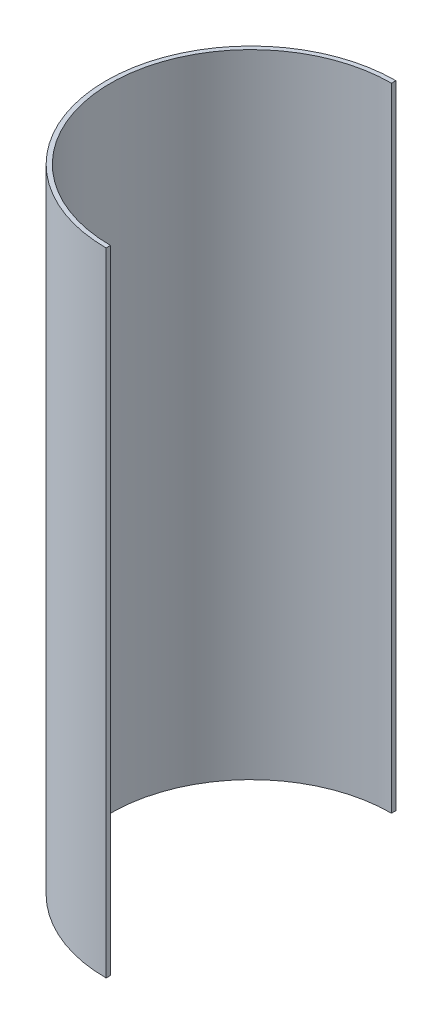
ISO-10303-21;
HEADER;
FILE_DESCRIPTION(('STEP AP214'),'2;1');
FILE_NAME('part.step','',(''),(''),'','','');
FILE_SCHEMA(('AUTOMOTIVE_DESIGN { 1 0 10303 214 1 1 1 1 }'));
ENDSEC;
DATA;
#1=APPLICATION_CONTEXT('core data for automotive mechanical design processes');
#2=APPLICATION_PROTOCOL_DEFINITION('international standard','automotive_design',2000,#1);
#3=PRODUCT_CONTEXT('',#1,'mechanical');
#4=PRODUCT('Part','Part','',(#3));
#5=PRODUCT_RELATED_PRODUCT_CATEGORY('part','',(#4));
#6=PRODUCT_DEFINITION_FORMATION('','',#4);
#7=PRODUCT_DEFINITION_CONTEXT('part definition',#1,'design');
#8=PRODUCT_DEFINITION('design','',#6,#7);
#9=PRODUCT_DEFINITION_SHAPE('','',#8);
#10=(LENGTH_UNIT() NAMED_UNIT(*) SI_UNIT(.MILLI.,.METRE.));
#11=(NAMED_UNIT(*) PLANE_ANGLE_UNIT() SI_UNIT($,.RADIAN.));
#12=(NAMED_UNIT(*) SI_UNIT($,.STERADIAN.) SOLID_ANGLE_UNIT());
#13=UNCERTAINTY_MEASURE_WITH_UNIT(LENGTH_MEASURE(1.E-05),#10,'distance_accuracy_value','');
#14=(GEOMETRIC_REPRESENTATION_CONTEXT(3) GLOBAL_UNCERTAINTY_ASSIGNED_CONTEXT((#13)) GLOBAL_UNIT_ASSIGNED_CONTEXT((#10,
#11,#12)) REPRESENTATION_CONTEXT('',''));
#15=CARTESIAN_POINT('',(0.,0.,0.));
#16=DIRECTION('',(0.,0.,1.));
#17=DIRECTION('',(1.,0.,0.));
#18=AXIS2_PLACEMENT_3D('',#15,#16,#17);
#19=CARTESIAN_POINT('',(0.,457.2,0.));
#20=DIRECTION('',(0.,-1.,0.));
#21=DIRECTION('',(0.,0.,-1.));
#22=AXIS2_PLACEMENT_3D('',#19,#20,#21);
#23=CYLINDRICAL_SURFACE('',#22,101.6);
#24=CARTESIAN_POINT('',(0.,0.,0.));
#25=DIRECTION('',(0.,-1.,0.));
#26=DIRECTION('',(0.,0.,1.));
#27=AXIS2_PLACEMENT_3D('',#24,#25,#26);
#28=CIRCLE('',#27,101.6);
#29=CARTESIAN_POINT('',(0.,0.,101.6));
#30=VERTEX_POINT('',#29);
#31=CARTESIAN_POINT('',(0.,0.,-101.6));
#32=VERTEX_POINT('',#31);
#33=EDGE_CURVE('E96',#30,#32,#28,.T.);
#34=ORIENTED_EDGE('',*,*,#33,.T.);
#35=DIRECTION('',(0.,-1.,0.));
#36=VECTOR('',#35,1.);
#37=CARTESIAN_POINT('',(0.,457.2,-101.6));
#38=LINE('',#37,#36);
#39=CARTESIAN_POINT('',(0.,457.2,-101.6));
#40=VERTEX_POINT('',#39);
#41=EDGE_CURVE('E11',#40,#32,#38,.T.);
#42=ORIENTED_EDGE('',*,*,#41,.F.);
#43=CARTESIAN_POINT('',(0.,457.2,0.));
#44=DIRECTION('',(0.,-1.,0.));
#45=DIRECTION('',(0.,0.,1.));
#46=AXIS2_PLACEMENT_3D('',#43,#44,#45);
#47=CIRCLE('',#46,101.6);
#48=CARTESIAN_POINT('',(0.,457.2,101.6));
#49=VERTEX_POINT('',#48);
#50=EDGE_CURVE('E84',#49,#40,#47,.T.);
#51=ORIENTED_EDGE('',*,*,#50,.F.);
#52=DIRECTION('',(0.,-1.,0.));
#53=VECTOR('',#52,1.);
#54=CARTESIAN_POINT('',(0.,457.2,101.6));
#55=LINE('',#54,#53);
#56=EDGE_CURVE('E92',#49,#30,#55,.T.);
#57=ORIENTED_EDGE('',*,*,#56,.T.);
#58=EDGE_LOOP('',(#34,#42,#51,#57));
#59=FACE_BOUND('',#58,.T.);
#60=ADVANCED_FACE('F33',(#59),#23,.F.);
#61=CARTESIAN_POINT('',(0.,457.2,-104.775));
#62=DIRECTION('',(-1.,0.,0.));
#63=DIRECTION('',(0.,0.,1.));
#64=AXIS2_PLACEMENT_3D('',#61,#62,#63);
#65=PLANE('',#64);
#66=DIRECTION('',(0.,0.,-1.));
#67=VECTOR('',#66,1.);
#68=CARTESIAN_POINT('',(0.,0.,-104.775));
#69=LINE('',#68,#67);
#70=CARTESIAN_POINT('',(0.,0.,-104.775));
#71=VERTEX_POINT('',#70);
#72=EDGE_CURVE('E88',#32,#71,#69,.T.);
#73=ORIENTED_EDGE('',*,*,#72,.T.);
#74=DIRECTION('',(0.,-1.,0.));
#75=VECTOR('',#74,1.);
#76=CARTESIAN_POINT('',(0.,457.2,-104.775));
#77=LINE('',#76,#75);
#78=CARTESIAN_POINT('',(0.,457.2,-104.775));
#79=VERTEX_POINT('',#78);
#80=EDGE_CURVE('E41',#79,#71,#77,.T.);
#81=ORIENTED_EDGE('',*,*,#80,.F.);
#82=DIRECTION('',(0.,0.,-1.));
#83=VECTOR('',#82,1.);
#84=CARTESIAN_POINT('',(0.,457.2,-104.775));
#85=LINE('',#84,#83);
#86=EDGE_CURVE('E79',#40,#79,#85,.T.);
#87=ORIENTED_EDGE('',*,*,#86,.F.);
#88=ORIENTED_EDGE('',*,*,#41,.T.);
#89=EDGE_LOOP('',(#73,#81,#87,#88));
#90=FACE_BOUND('',#89,.T.);
#91=ADVANCED_FACE('F87',(#90),#65,.F.);
#92=CARTESIAN_POINT('',(0.,457.2,0.));
#93=DIRECTION('',(0.,-1.,0.));
#94=DIRECTION('',(0.,0.,-1.));
#95=AXIS2_PLACEMENT_3D('',#92,#93,#94);
#96=CYLINDRICAL_SURFACE('',#95,104.775);
#97=CARTESIAN_POINT('',(0.,0.,0.));
#98=DIRECTION('',(0.,1.,0.));
#99=DIRECTION('',(0.,0.,1.));
#100=AXIS2_PLACEMENT_3D('',#97,#98,#99);
#101=CIRCLE('',#100,104.775);
#102=CARTESIAN_POINT('',(0.,0.,104.775));
#103=VERTEX_POINT('',#102);
#104=EDGE_CURVE('E66',#71,#103,#101,.T.);
#105=ORIENTED_EDGE('',*,*,#104,.T.);
#106=DIRECTION('',(0.,-1.,0.));
#107=VECTOR('',#106,1.);
#108=CARTESIAN_POINT('',(0.,457.2,104.775));
#109=LINE('',#108,#107);
#110=CARTESIAN_POINT('',(0.,457.2,104.775));
#111=VERTEX_POINT('',#110);
#112=EDGE_CURVE('E89',#111,#103,#109,.T.);
#113=ORIENTED_EDGE('',*,*,#112,.F.);
#114=CARTESIAN_POINT('',(0.,457.2,0.));
#115=DIRECTION('',(0.,1.,0.));
#116=DIRECTION('',(0.,0.,1.));
#117=AXIS2_PLACEMENT_3D('',#114,#115,#116);
#118=CIRCLE('',#117,104.775);
#119=EDGE_CURVE('E82',#79,#111,#118,.T.);
#120=ORIENTED_EDGE('',*,*,#119,.F.);
#121=ORIENTED_EDGE('',*,*,#80,.T.);
#122=EDGE_LOOP('',(#105,#113,#120,#121));
#123=FACE_BOUND('',#122,.T.);
#124=ADVANCED_FACE('F90',(#123),#96,.T.);
#125=CARTESIAN_POINT('',(0.,457.2,101.6));
#126=DIRECTION('',(-1.,0.,0.));
#127=DIRECTION('',(0.,0.,1.));
#128=AXIS2_PLACEMENT_3D('',#125,#126,#127);
#129=PLANE('',#128);
#130=DIRECTION('',(0.,0.,-1.));
#131=VECTOR('',#130,1.);
#132=CARTESIAN_POINT('',(0.,0.,101.6));
#133=LINE('',#132,#131);
#134=EDGE_CURVE('E72',#103,#30,#133,.T.);
#135=ORIENTED_EDGE('',*,*,#134,.T.);
#136=ORIENTED_EDGE('',*,*,#56,.F.);
#137=DIRECTION('',(0.,0.,-1.));
#138=VECTOR('',#137,1.);
#139=CARTESIAN_POINT('',(0.,457.2,101.6));
#140=LINE('',#139,#138);
#141=EDGE_CURVE('E49',#111,#49,#140,.T.);
#142=ORIENTED_EDGE('',*,*,#141,.F.);
#143=ORIENTED_EDGE('',*,*,#112,.T.);
#144=EDGE_LOOP('',(#135,#136,#142,#143));
#145=FACE_BOUND('',#144,.T.);
#146=ADVANCED_FACE('F103',(#145),#129,.F.);
#147=CARTESIAN_POINT('',(0.,457.2,0.));
#148=DIRECTION('',(0.,1.,0.));
#149=DIRECTION('',(0.,0.,1.));
#150=AXIS2_PLACEMENT_3D('',#147,#148,#149);
#151=PLANE('',#150);
#152=ORIENTED_EDGE('',*,*,#50,.T.);
#153=ORIENTED_EDGE('',*,*,#86,.T.);
#154=ORIENTED_EDGE('',*,*,#119,.T.);
#155=ORIENTED_EDGE('',*,*,#141,.T.);
#156=EDGE_LOOP('',(#152,#153,#154,#155));
#157=FACE_BOUND('',#156,.T.);
#158=ADVANCED_FACE('F80',(#157),#151,.T.);
#159=CARTESIAN_POINT('',(0.,0.,0.));
#160=DIRECTION('',(0.,1.,0.));
#161=DIRECTION('',(0.,0.,1.));
#162=AXIS2_PLACEMENT_3D('',#159,#160,#161);
#163=PLANE('',#162);
#164=ORIENTED_EDGE('',*,*,#33,.F.);
#165=ORIENTED_EDGE('',*,*,#134,.F.);
#166=ORIENTED_EDGE('',*,*,#104,.F.);
#167=ORIENTED_EDGE('',*,*,#72,.F.);
#168=EDGE_LOOP('',(#164,#165,#166,#167));
#169=FACE_BOUND('',#168,.T.);
#170=ADVANCED_FACE('F106',(#169),#163,.F.);
#171=CLOSED_SHELL('',(#60,#91,#124,#146,#158,#170));
#172=MANIFOLD_SOLID_BREP('B2',#171);
#173=ADVANCED_BREP_SHAPE_REPRESENTATION('',(#18,#172),#14);
#174=SHAPE_DEFINITION_REPRESENTATION(#9,#173);
ENDSEC;
END-ISO-10303-21;
